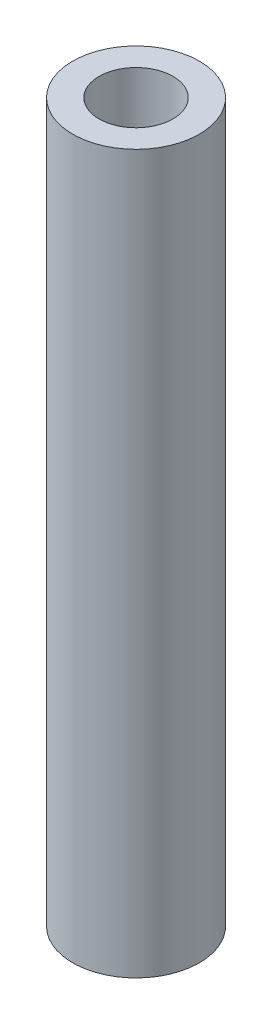
ISO-10303-21;
HEADER;
FILE_DESCRIPTION(('STEP AP214'),'2;1');
FILE_NAME('part.step','',(''),(''),'','','');
FILE_SCHEMA(('AUTOMOTIVE_DESIGN { 1 0 10303 214 1 1 1 1 }'));
ENDSEC;
DATA;
#1=APPLICATION_CONTEXT('core data for automotive mechanical design processes');
#2=APPLICATION_PROTOCOL_DEFINITION('international standard','automotive_design',2000,#1);
#3=PRODUCT_CONTEXT('',#1,'mechanical');
#4=PRODUCT('Part','Part','',(#3));
#5=PRODUCT_RELATED_PRODUCT_CATEGORY('part','',(#4));
#6=PRODUCT_DEFINITION_FORMATION('','',#4);
#7=PRODUCT_DEFINITION_CONTEXT('part definition',#1,'design');
#8=PRODUCT_DEFINITION('design','',#6,#7);
#9=PRODUCT_DEFINITION_SHAPE('','',#8);
#10=(LENGTH_UNIT() NAMED_UNIT(*) SI_UNIT(.MILLI.,.METRE.));
#11=(NAMED_UNIT(*) PLANE_ANGLE_UNIT() SI_UNIT($,.RADIAN.));
#12=(NAMED_UNIT(*) SI_UNIT($,.STERADIAN.) SOLID_ANGLE_UNIT());
#13=UNCERTAINTY_MEASURE_WITH_UNIT(LENGTH_MEASURE(1.E-05),#10,'distance_accuracy_value','');
#14=(GEOMETRIC_REPRESENTATION_CONTEXT(3) GLOBAL_UNCERTAINTY_ASSIGNED_CONTEXT((#13)) GLOBAL_UNIT_ASSIGNED_CONTEXT((#10,
#11,#12)) REPRESENTATION_CONTEXT('',''));
#15=CARTESIAN_POINT('',(0.,0.,0.));
#16=DIRECTION('',(0.,0.,1.));
#17=DIRECTION('',(1.,0.,0.));
#18=AXIS2_PLACEMENT_3D('',#15,#16,#17);
#19=CARTESIAN_POINT('',(15.500000230968,37.,7.00000010430813));
#20=DIRECTION('',(0.,-1.,0.));
#21=DIRECTION('',(0.,0.,-1.));
#22=AXIS2_PLACEMENT_3D('',#19,#20,#21);
#23=CYLINDRICAL_SURFACE('',#22,0.874999999999999);
#24=CARTESIAN_POINT('',(15.500000230968,37.,7.00000010430813));
#25=DIRECTION('',(0.,-1.,0.));
#26=DIRECTION('',(0.,0.,-1.));
#27=AXIS2_PLACEMENT_3D('',#24,#25,#26);
#28=CIRCLE('',#27,0.874999999999999);
#29=CARTESIAN_POINT('',(15.500000230968,37.,6.12500010430813));
#30=VERTEX_POINT('',#29);
#31=EDGE_CURVE('E27',#30,#30,#28,.T.);
#32=ORIENTED_EDGE('',*,*,#31,.F.);
#33=EDGE_LOOP('',(#32));
#34=FACE_BOUND('',#33,.T.);
#35=CARTESIAN_POINT('',(15.500000230968,20.,7.00000010430813));
#36=DIRECTION('',(0.,-1.,0.));
#37=DIRECTION('',(0.,0.,-1.));
#38=AXIS2_PLACEMENT_3D('',#35,#36,#37);
#39=CIRCLE('',#38,0.874999999999999);
#40=CARTESIAN_POINT('',(15.500000230968,20.,6.12500010430813));
#41=VERTEX_POINT('',#40);
#42=EDGE_CURVE('E18',#41,#41,#39,.T.);
#43=ORIENTED_EDGE('',*,*,#42,.T.);
#44=EDGE_LOOP('',(#43));
#45=FACE_BOUND('',#44,.T.);
#46=ADVANCED_FACE('F15',(#34,#45),#23,.F.);
#47=CARTESIAN_POINT('',(15.500000230968,20.,7.00000010430813));
#48=DIRECTION('',(0.,1.,0.));
#49=DIRECTION('',(0.,0.,1.));
#50=AXIS2_PLACEMENT_3D('',#47,#48,#49);
#51=PLANE('',#50);
#52=ORIENTED_EDGE('',*,*,#42,.F.);
#53=EDGE_LOOP('',(#52));
#54=FACE_BOUND('',#53,.T.);
#55=CARTESIAN_POINT('',(15.500000230968,20.,7.00000010430813));
#56=DIRECTION('',(0.,-1.,0.));
#57=DIRECTION('',(0.,0.,-1.));
#58=AXIS2_PLACEMENT_3D('',#55,#56,#57);
#59=CIRCLE('',#58,1.5);
#60=CARTESIAN_POINT('',(15.500000230968,20.,5.50000010430813));
#61=VERTEX_POINT('',#60);
#62=EDGE_CURVE('E22',#61,#61,#59,.F.);
#63=ORIENTED_EDGE('',*,*,#62,.F.);
#64=EDGE_LOOP('',(#63));
#65=FACE_BOUND('',#64,.T.);
#66=ADVANCED_FACE('F36',(#54,#65),#51,.F.);
#67=CARTESIAN_POINT('',(15.500000230968,37.,7.00000010430813));
#68=DIRECTION('',(0.,1.,0.));
#69=DIRECTION('',(0.,0.,1.));
#70=AXIS2_PLACEMENT_3D('',#67,#68,#69);
#71=PLANE('',#70);
#72=ORIENTED_EDGE('',*,*,#31,.T.);
#73=EDGE_LOOP('',(#72));
#74=FACE_BOUND('',#73,.T.);
#75=CARTESIAN_POINT('',(15.500000230968,37.,7.00000010430813));
#76=DIRECTION('',(0.,-1.,0.));
#77=DIRECTION('',(0.,0.,-1.));
#78=AXIS2_PLACEMENT_3D('',#75,#76,#77);
#79=CIRCLE('',#78,1.5);
#80=CARTESIAN_POINT('',(15.500000230968,37.,5.50000010430813));
#81=VERTEX_POINT('',#80);
#82=EDGE_CURVE('E10',#81,#81,#79,.T.);
#83=ORIENTED_EDGE('',*,*,#82,.F.);
#84=EDGE_LOOP('',(#83));
#85=FACE_BOUND('',#84,.T.);
#86=ADVANCED_FACE('F39',(#74,#85),#71,.T.);
#87=CARTESIAN_POINT('',(15.500000230968,37.,7.00000010430813));
#88=DIRECTION('',(0.,-1.,0.));
#89=DIRECTION('',(0.,0.,-1.));
#90=AXIS2_PLACEMENT_3D('',#87,#88,#89);
#91=CYLINDRICAL_SURFACE('',#90,1.5);
#92=ORIENTED_EDGE('',*,*,#82,.T.);
#93=EDGE_LOOP('',(#92));
#94=FACE_BOUND('',#93,.T.);
#95=ORIENTED_EDGE('',*,*,#62,.T.);
#96=EDGE_LOOP('',(#95));
#97=FACE_BOUND('',#96,.T.);
#98=ADVANCED_FACE('F42',(#94,#97),#91,.T.);
#99=CLOSED_SHELL('',(#46,#66,#86,#98));
#100=MANIFOLD_SOLID_BREP('B1',#99);
#101=ADVANCED_BREP_SHAPE_REPRESENTATION('',(#18,#100),#14);
#102=SHAPE_DEFINITION_REPRESENTATION(#9,#101);
ENDSEC;
END-ISO-10303-21;
